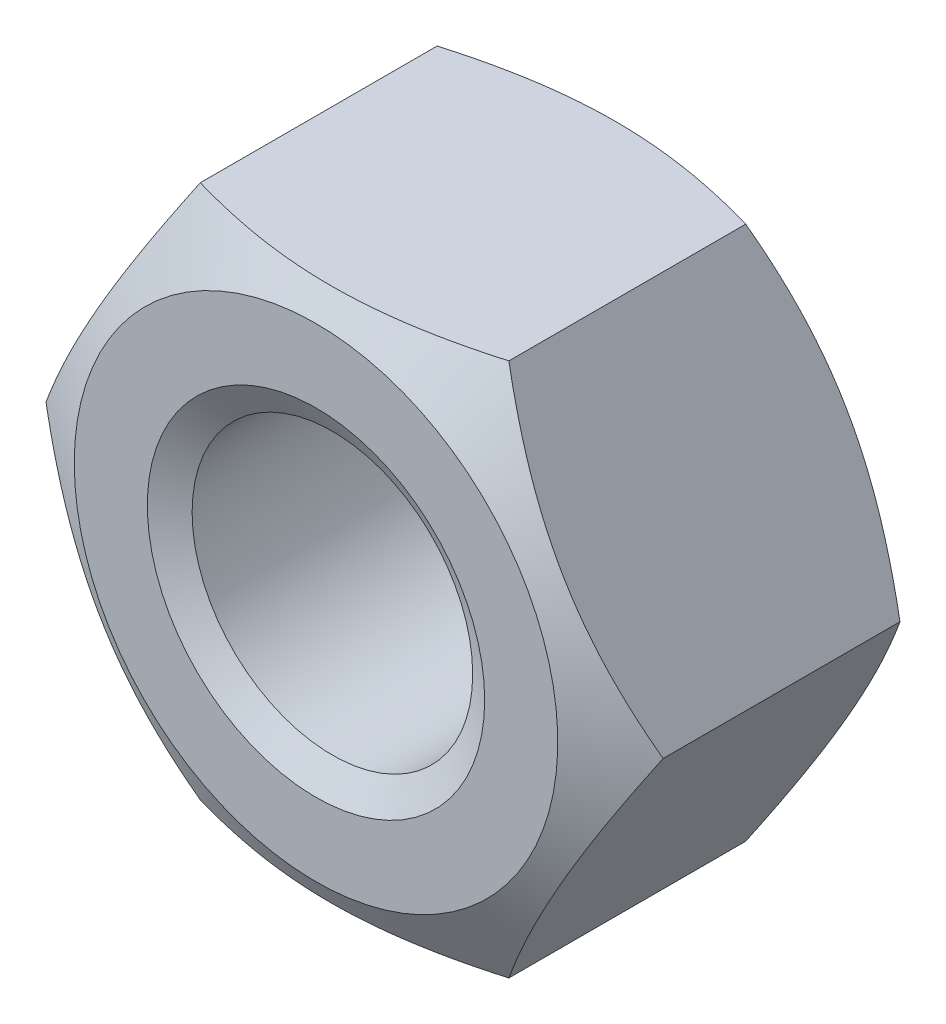
ISO-10303-21;
HEADER;
FILE_DESCRIPTION(('STEP AP214'),'2;1');
FILE_NAME('part.step','',(''),(''),'','','');
FILE_SCHEMA(('AUTOMOTIVE_DESIGN { 1 0 10303 214 1 1 1 1 }'));
ENDSEC;
DATA;
#1=APPLICATION_CONTEXT('core data for automotive mechanical design processes');
#2=APPLICATION_PROTOCOL_DEFINITION('international standard','automotive_design',2000,#1);
#3=PRODUCT_CONTEXT('',#1,'mechanical');
#4=PRODUCT('Part','Part','',(#3));
#5=PRODUCT_RELATED_PRODUCT_CATEGORY('part','',(#4));
#6=PRODUCT_DEFINITION_FORMATION('','',#4);
#7=PRODUCT_DEFINITION_CONTEXT('part definition',#1,'design');
#8=PRODUCT_DEFINITION('design','',#6,#7);
#9=PRODUCT_DEFINITION_SHAPE('','',#8);
#10=(LENGTH_UNIT() NAMED_UNIT(*) SI_UNIT(.MILLI.,.METRE.));
#11=(NAMED_UNIT(*) PLANE_ANGLE_UNIT() SI_UNIT($,.RADIAN.));
#12=(NAMED_UNIT(*) SI_UNIT($,.STERADIAN.) SOLID_ANGLE_UNIT());
#13=UNCERTAINTY_MEASURE_WITH_UNIT(LENGTH_MEASURE(1.E-05),#10,'distance_accuracy_value','');
#14=(GEOMETRIC_REPRESENTATION_CONTEXT(3) GLOBAL_UNCERTAINTY_ASSIGNED_CONTEXT((#13)) GLOBAL_UNIT_ASSIGNED_CONTEXT((#10,
#11,#12)) REPRESENTATION_CONTEXT('',''));
#15=CARTESIAN_POINT('',(0.,0.,0.));
#16=DIRECTION('',(0.,0.,1.));
#17=DIRECTION('',(1.,0.,0.));
#18=AXIS2_PLACEMENT_3D('',#15,#16,#17);
#19=CARTESIAN_POINT('',(0.,0.,4.70000000000004));
#20=DIRECTION('',(0.,0.,1.));
#21=DIRECTION('',(1.,0.,0.));
#22=AXIS2_PLACEMENT_3D('',#19,#20,#21);
#23=PLANE('',#22);
#24=CARTESIAN_POINT('',(0.,0.,4.70000000000004));
#25=DIRECTION('',(0.,0.,1.));
#26=DIRECTION('',(1.,0.,0.));
#27=AXIS2_PLACEMENT_3D('',#24,#25,#26);
#28=CIRCLE('',#27,2.525);
#29=CARTESIAN_POINT('',(2.525,0.,4.70000000000004));
#30=VERTEX_POINT('',#29);
#31=EDGE_CURVE('E123',#30,#30,#28,.T.);
#32=ORIENTED_EDGE('',*,*,#31,.F.);
#33=EDGE_LOOP('',(#32));
#34=FACE_BOUND('',#33,.T.);
#35=CARTESIAN_POINT('',(0.,0.,4.70000000000004));
#36=DIRECTION('',(0.,0.,-1.));
#37=DIRECTION('',(-1.,0.,0.));
#38=AXIS2_PLACEMENT_3D('',#35,#36,#37);
#39=CIRCLE('',#38,3.61880215351701);
#40=CARTESIAN_POINT('',(-3.61880215351701,0.,4.70000000000004));
#41=VERTEX_POINT('',#40);
#42=EDGE_CURVE('E244',#41,#41,#39,.T.);
#43=ORIENTED_EDGE('',*,*,#42,.F.);
#44=EDGE_LOOP('',(#43));
#45=FACE_BOUND('',#44,.T.);
#46=ADVANCED_FACE('F36',(#34,#45),#23,.T.);
#47=CARTESIAN_POINT('',(0.,0.,0.));
#48=DIRECTION('',(0.,0.,1.));
#49=DIRECTION('',(1.,0.,0.));
#50=AXIS2_PLACEMENT_3D('',#47,#48,#49);
#51=PLANE('',#50);
#52=CARTESIAN_POINT('',(0.,0.,0.));
#53=DIRECTION('',(0.,0.,1.));
#54=DIRECTION('',(1.,0.,0.));
#55=AXIS2_PLACEMENT_3D('',#52,#53,#54);
#56=CIRCLE('',#55,2.525);
#57=CARTESIAN_POINT('',(2.525,0.,0.));
#58=VERTEX_POINT('',#57);
#59=EDGE_CURVE('E126',#58,#58,#56,.T.);
#60=ORIENTED_EDGE('',*,*,#59,.T.);
#61=EDGE_LOOP('',(#60));
#62=FACE_BOUND('',#61,.T.);
#63=CARTESIAN_POINT('',(0.,0.,0.));
#64=DIRECTION('',(0.,0.,-1.));
#65=DIRECTION('',(-1.,0.,0.));
#66=AXIS2_PLACEMENT_3D('',#63,#64,#65);
#67=CIRCLE('',#66,3.61880215351701);
#68=CARTESIAN_POINT('',(-3.61880215351701,0.,0.));
#69=VERTEX_POINT('',#68);
#70=EDGE_CURVE('E199',#69,#69,#67,.T.);
#71=ORIENTED_EDGE('',*,*,#70,.T.);
#72=EDGE_LOOP('',(#71));
#73=FACE_BOUND('',#72,.T.);
#74=ADVANCED_FACE('F219',(#62,#73),#51,.F.);
#75=CARTESIAN_POINT('',(4.61880215351701,0.,4.70000000000004));
#76=DIRECTION('',(-0.866025403784439,-0.5,0.));
#77=DIRECTION('',(0.5,-0.866025403784439,0.));
#78=AXIS2_PLACEMENT_3D('',#75,#76,#77);
#79=PLANE('',#78);
#80=DIRECTION('',(0.,0.,-1.));
#81=VECTOR('',#80,1.);
#82=CARTESIAN_POINT('',(2.3094010767585,4.,4.70000000000004));
#83=LINE('',#82,#81);
#84=CARTESIAN_POINT('',(2.3094010767585,4.,4.12264973081033));
#85=VERTEX_POINT('',#84);
#86=CARTESIAN_POINT('',(2.3094010767585,4.,0.577350269189592));
#87=VERTEX_POINT('',#86);
#88=EDGE_CURVE('E11',#85,#87,#83,.T.);
#89=ORIENTED_EDGE('',*,*,#88,.F.);
#90=CARTESIAN_POINT('',(2.30928560670467,4.0002,4.12258306164381));
#91=CARTESIAN_POINT('',(2.41077174646171,3.82442084967677,4.1811974470703));
#92=CARTESIAN_POINT('',(2.513133908835,3.64712438367362,4.23450499925632));
#93=CARTESIAN_POINT('',(2.71963072479812,3.2894614068243,4.32755364997217));
#94=CARTESIAN_POINT('',(2.82376904741904,3.10908854102986,4.36726183168887));
#95=CARTESIAN_POINT('',(3.03075510011795,2.75057818129722,4.4290731054383));
#96=CARTESIAN_POINT('',(3.13357098372492,2.57249584706487,4.45158758919571));
#97=CARTESIAN_POINT('',(3.33968651028528,2.2154932828335,4.47846469757197));
#98=CARTESIAN_POINT('',(3.44298540411433,2.0365743503559,4.48284957929155));
#99=CARTESIAN_POINT('',(3.63600352522932,1.70225715780327,4.47372524777853));
#100=CARTESIAN_POINT('',(3.72575165335065,1.54680884001293,4.46245636673056));
#101=CARTESIAN_POINT('',(3.90466320392055,1.23692494436494,4.4267413299204));
#102=CARTESIAN_POINT('',(3.99382600759479,1.08249043825587,4.40228297500705));
#103=CARTESIAN_POINT('',(4.17310641015197,0.77196767222542,4.34113925579928));
#104=CARTESIAN_POINT('',(4.26320131938131,0.615918711936898,4.30419471706371));
#105=CARTESIAN_POINT('',(4.44204742827551,0.306148164596163,4.22034524817056));
#106=CARTESIAN_POINT('',(4.53080091904967,0.152422609226223,4.17346001850585));
#107=CARTESIAN_POINT('',(4.61891762357085,-0.000199999999998812,4.12258306164381));
#108=B_SPLINE_CURVE_WITH_KNOTS('',3,(#90,#91,#92,#93,#94,#95,#96,#97,#98,#99,#100,#101,#102,
#103,#104,#105,#106,#107),.UNSPECIFIED.,.F.,.F.,(4,2,2,2,2,2,2,2,4),(0.,0.634047835695967,
1.26961969224542,1.88946157213121,2.50854226669296,3.04757825393385,3.58711366126903,
4.13861653143763,4.68903648037742),.UNSPECIFIED.);
#109=CARTESIAN_POINT('',(4.61880215351701,0.,4.12264973081033));
#110=VERTEX_POINT('',#109);
#111=EDGE_CURVE('E195',#85,#110,#108,.T.);
#112=ORIENTED_EDGE('',*,*,#111,.T.);
#113=DIRECTION('',(0.,0.,-1.));
#114=VECTOR('',#113,1.);
#115=CARTESIAN_POINT('',(4.61880215351701,0.,4.70000000000004));
#116=LINE('',#115,#114);
#117=CARTESIAN_POINT('',(4.61880215351701,0.,0.577350269189592));
#118=VERTEX_POINT('',#117);
#119=EDGE_CURVE('E60',#110,#118,#116,.T.);
#120=ORIENTED_EDGE('',*,*,#119,.T.);
#121=CARTESIAN_POINT('',(4.61891762357085,-0.000199999999998812,0.577416938356223));
#122=CARTESIAN_POINT('',(4.51743148381381,0.175579150323227,0.518802552929724));
#123=CARTESIAN_POINT('',(4.41506932144052,0.352875616326379,0.465495000743697));
#124=CARTESIAN_POINT('',(4.2085725054774,0.710538593175705,0.372446350027833));
#125=CARTESIAN_POINT('',(4.10443418285647,0.890911458970151,0.332738168311136));
#126=CARTESIAN_POINT('',(3.89744813015756,1.24942181870279,0.270926894561713));
#127=CARTESIAN_POINT('',(3.7946322465506,1.42750415293514,0.248412410804324));
#128=CARTESIAN_POINT('',(3.58851671999023,1.78450671716651,0.221535302428014));
#129=CARTESIAN_POINT('',(3.48521782616117,1.9634256496441,0.217150420708372));
#130=CARTESIAN_POINT('',(3.29219970504619,2.29774284219673,0.226274752221399));
#131=CARTESIAN_POINT('',(3.20245157692486,2.45319115998707,0.237543633269426));
#132=CARTESIAN_POINT('',(3.02354002635497,2.76307505563506,0.273258670079627));
#133=CARTESIAN_POINT('',(2.93437722268073,2.91750956174413,0.297717024992966));
#134=CARTESIAN_POINT('',(2.75509682012354,3.22803232777458,0.35886074420072));
#135=CARTESIAN_POINT('',(2.6650019108942,3.3840812880631,0.395805282936293));
#136=CARTESIAN_POINT('',(2.48615580200001,3.69385183540384,0.479654751829461));
#137=CARTESIAN_POINT('',(2.39740231122585,3.84757739077378,0.526539981494181));
#138=CARTESIAN_POINT('',(2.30928560670467,4.0002,0.577416938356223));
#139=B_SPLINE_CURVE_WITH_KNOTS('',3,(#121,#122,#123,#124,#125,#126,#127,#128,#129,#130,#131,
#132,#133,#134,#135,#136,#137,#138),.UNSPECIFIED.,.F.,.F.,(4,2,2,2,2,2,2,2,4),(0.,
0.634047835695969,1.26961969224544,1.88946157213123,2.50854226669298,3.04757825393386,
3.58711366126904,4.13861653143764,4.68903648037744),.UNSPECIFIED.);
#140=EDGE_CURVE('E129',#118,#87,#139,.T.);
#141=ORIENTED_EDGE('',*,*,#140,.T.);
#142=EDGE_LOOP('',(#89,#112,#120,#141));
#143=FACE_BOUND('',#142,.T.);
#144=ADVANCED_FACE('F38',(#143),#79,.F.);
#145=CARTESIAN_POINT('',(2.3094010767585,4.,4.70000000000004));
#146=DIRECTION('',(0.,-1.,0.));
#147=DIRECTION('',(0.,0.,-1.));
#148=AXIS2_PLACEMENT_3D('',#145,#146,#147);
#149=PLANE('',#148);
#150=DIRECTION('',(0.,0.,-1.));
#151=VECTOR('',#150,1.);
#152=CARTESIAN_POINT('',(-2.3094010767585,4.,4.70000000000004));
#153=LINE('',#152,#151);
#154=CARTESIAN_POINT('',(-2.3094010767585,4.,4.12264973081033));
#155=VERTEX_POINT('',#154);
#156=CARTESIAN_POINT('',(-2.3094010767585,4.,0.577350269189592));
#157=VERTEX_POINT('',#156);
#158=EDGE_CURVE('E45',#155,#157,#153,.T.);
#159=ORIENTED_EDGE('',*,*,#158,.F.);
#160=CARTESIAN_POINT('',(-6.09439870008624,4.,2.58052815081933));
#161=CARTESIAN_POINT('',(-5.92056709462127,4.,2.66440799071056));
#162=CARTESIAN_POINT('',(-5.7463245067722,4.,2.74745133273696));
#163=CARTESIAN_POINT('',(-5.39679834745252,4.,2.91139217879107));
#164=CARTESIAN_POINT('',(-5.22151460659659,4.,2.99228932126199));
#165=CARTESIAN_POINT('',(-4.86873058864552,4.,3.15189554384562));
#166=CARTESIAN_POINT('',(-4.6912233581124,4.,3.2305893099155));
#167=CARTESIAN_POINT('',(-4.33475821937682,4.,3.3846069905837));
#168=CARTESIAN_POINT('',(-4.15580038365535,4.,3.45993107234068));
#169=CARTESIAN_POINT('',(-3.7908281407519,4.,3.60848180478433));
#170=CARTESIAN_POINT('',(-3.60476145616704,4.,3.68158074442146));
#171=CARTESIAN_POINT('',(-3.23041138049854,4.,3.82197762836034));
#172=CARTESIAN_POINT('',(-3.04212773780156,4.,3.88927490684799));
#173=CARTESIAN_POINT('',(-2.66343337031665,4.,4.01622155863231));
#174=CARTESIAN_POINT('',(-2.47302822636961,4.,4.0758874066397));
#175=CARTESIAN_POINT('',(-2.08949007377857,4.,4.18558533105624));
#176=CARTESIAN_POINT('',(-1.89635797998642,4.,4.23562055967113));
#177=CARTESIAN_POINT('',(-1.50829712802515,4.,4.32332847661919));
#178=CARTESIAN_POINT('',(-1.31338269521051,4.,4.36106334898366));
#179=CARTESIAN_POINT('',(-0.921248890898837,4.,4.42196109737901));
#180=CARTESIAN_POINT('',(-0.724029704709688,4.,4.4451251368414));
#181=CARTESIAN_POINT('',(-0.330799463054093,4.,4.47472893675917));
#182=CARTESIAN_POINT('',(-0.134804330623294,4.,4.48137503581725));
#183=CARTESIAN_POINT('',(0.257050683814243,4.,4.47791638574248));
#184=CARTESIAN_POINT('',(0.45291056081257,4.,4.46781104643771));
#185=CARTESIAN_POINT('',(0.78874443502392,4.,4.43681930503576));
#186=CARTESIAN_POINT('',(0.929086770300285,4.,4.41972062365012));
#187=CARTESIAN_POINT('',(1.20866508678393,4.,4.37804812784635));
#188=CARTESIAN_POINT('',(1.34790090032354,4.,4.35347320193115));
#189=CARTESIAN_POINT('',(1.76380719352866,4.,4.26983435980247));
#190=CARTESIAN_POINT('',(2.03850546613734,4.,4.20087417576413));
#191=CARTESIAN_POINT('',(2.44914041313838,4.,4.08229833701357));
#192=CARTESIAN_POINT('',(2.58722904476809,4.,4.03971908518976));
#193=CARTESIAN_POINT('',(2.862063667265,4.,3.95039002095297));
#194=CARTESIAN_POINT('',(2.99880964951352,4.,3.90364018178769));
#195=CARTESIAN_POINT('',(3.271007501521,4.,3.80669907645057));
#196=CARTESIAN_POINT('',(3.40645983587404,4.,3.75650910310509));
#197=CARTESIAN_POINT('',(3.67625919824858,4.,3.65325267369425));
#198=CARTESIAN_POINT('',(3.81060623649641,4.,3.60018624427675));
#199=CARTESIAN_POINT('',(4.11562280524895,4.,3.47653935993073));
#200=CARTESIAN_POINT('',(4.28598349292156,4.,3.40519857633256));
#201=CARTESIAN_POINT('',(4.62536345858144,4.,3.25938802038879));
#202=CARTESIAN_POINT('',(4.79438267316525,4.,3.18491810118228));
#203=CARTESIAN_POINT('',(5.29980589587935,4.,2.9577393040658));
#204=CARTESIAN_POINT('',(5.63452374641144,4.,2.80128282124505));
#205=CARTESIAN_POINT('',(6.30104248196814,4.,2.48161328613526));
#206=CARTESIAN_POINT('',(6.63284058362901,4.,2.31839448840645));
#207=CARTESIAN_POINT('',(7.29412827568044,4.,1.98733042741953));
#208=CARTESIAN_POINT('',(7.62361779163159,4.,1.81948501583132));
#209=CARTESIAN_POINT('',(8.25536205328134,4.,1.4936414860704));
#210=CARTESIAN_POINT('',(8.55774483760872,4.,1.33589080531252));
#211=CARTESIAN_POINT('',(9.16139293352011,4.,1.01824729645359));
#212=CARTESIAN_POINT('',(9.46265821309699,4.,0.858354407592023));
#213=CARTESIAN_POINT('',(10.0636644368672,4.,0.537267315517387));
#214=CARTESIAN_POINT('',(10.3634072636687,4.,0.376076631097769));
#215=CARTESIAN_POINT('',(10.9621713423212,4.,0.0523938980102709));
#216=CARTESIAN_POINT('',(11.2611926277831,4.,-0.110098088455319));
#217=CARTESIAN_POINT('',(11.5599448570052,4.,-0.273079916735308));
#218=B_SPLINE_CURVE_WITH_KNOTS('',3,(#160,#161,#162,#163,#164,#165,#166,#167,#168,#169,#170,
#171,#172,#173,#174,#175,#176,#177,#178,#179,#180,#181,#182,#183,#184,#185,#186,#187,#188,#189,
#190,#191,#192,#193,#194,#195,#196,#197,#198,#199,#200,#201,#202,#203,#204,#205,#206,#207,#208,
#209,#210,#211,#212,#213,#214,#215,#216,#217),.UNSPECIFIED.,.F.,.F.,(4,2,2,2,2,2,2,2,2,2,2,2,2,
2,2,2,2,2,2,2,2,2,2,2,2,2,2,2,4),(0.,0.579040698495303,1.15817833277575,1.74065677904911,
2.32310629841798,2.92276353531228,3.52248949911162,4.12089810200277,4.71911050497446,
5.31424999029614,5.90934194971789,6.49696191831524,7.08460258986092,7.50853513536051,
7.93253073795216,8.78103558083006,9.21451485463262,9.64799690919332,10.0813169420328,
10.5146329612257,11.0686769640889,11.6227469992164,12.7310549948479,13.8403247652097,
14.9496301404199,15.9727943925241,16.9959877268381,18.0169905333094,19.0379448236906),.UNSPECIFIED.);
#219=EDGE_CURVE('E94',#155,#85,#218,.T.);
#220=ORIENTED_EDGE('',*,*,#219,.T.);
#221=ORIENTED_EDGE('',*,*,#88,.T.);
#222=CARTESIAN_POINT('',(-6.09439870008624,4.,2.11947184918071));
#223=CARTESIAN_POINT('',(-5.92056709462127,4.,2.03559200928946));
#224=CARTESIAN_POINT('',(-5.74632450677221,4.,1.95254866726305));
#225=CARTESIAN_POINT('',(-5.39679834745253,4.,1.78860782120894));
#226=CARTESIAN_POINT('',(-5.2215146065966,4.,1.70771067873802));
#227=CARTESIAN_POINT('',(-4.86873058864553,4.,1.5481044561544));
#228=CARTESIAN_POINT('',(-4.69122335811241,4.,1.46941069008451));
#229=CARTESIAN_POINT('',(-4.33475821937683,4.,1.31539300941632));
#230=CARTESIAN_POINT('',(-4.15580038365536,4.,1.24006892765934));
#231=CARTESIAN_POINT('',(-3.79082814075191,4.,1.09151819521569));
#232=CARTESIAN_POINT('',(-3.60476145616705,4.,1.01841925557855));
#233=CARTESIAN_POINT('',(-3.23041138049855,4.,0.878022371639671));
#234=CARTESIAN_POINT('',(-3.04212773780157,4.,0.810725093152023));
#235=CARTESIAN_POINT('',(-2.66343337031666,4.,0.683778441367701));
#236=CARTESIAN_POINT('',(-2.47302822636962,4.,0.62411259336031));
#237=CARTESIAN_POINT('',(-2.08949007377858,4.,0.514414668943782));
#238=CARTESIAN_POINT('',(-1.89635797998642,4.,0.464379440328912));
#239=CARTESIAN_POINT('',(-1.50829712802515,4.,0.376671523380852));
#240=CARTESIAN_POINT('',(-1.31338269521051,4.,0.338936651016357));
#241=CARTESIAN_POINT('',(-0.92124889089884,4.,0.278038902620989));
#242=CARTESIAN_POINT('',(-0.724029704709691,4.,0.254874863158613));
#243=CARTESIAN_POINT('',(-0.330799463054095,4.,0.225271063240843));
#244=CARTESIAN_POINT('',(-0.134804330623296,4.,0.218624964182749));
#245=CARTESIAN_POINT('',(0.257050683814241,4.,0.222083614257543));
#246=CARTESIAN_POINT('',(0.452910560812568,4.,0.23218895356233));
#247=CARTESIAN_POINT('',(0.788744435023922,4.,0.263180694964278));
#248=CARTESIAN_POINT('',(0.929086770300289,4.,0.280279376349894));
#249=CARTESIAN_POINT('',(1.20866508678394,4.,0.321951872153655));
#250=CARTESIAN_POINT('',(1.34790090032354,4.,0.346526798068861));
#251=CARTESIAN_POINT('',(1.76380719352866,4.,0.430165640197547));
#252=CARTESIAN_POINT('',(2.03850546613734,4.,0.49912582423588));
#253=CARTESIAN_POINT('',(2.44914041313839,4.,0.617701662986443));
#254=CARTESIAN_POINT('',(2.5872290447681,4.,0.660280914810251));
#255=CARTESIAN_POINT('',(2.86206366726501,4.,0.749609979047047));
#256=CARTESIAN_POINT('',(2.99880964951353,4.,0.79635981821232));
#257=CARTESIAN_POINT('',(3.27100750152101,4.,0.89330092354944));
#258=CARTESIAN_POINT('',(3.40645983587405,4.,0.943490896894921));
#259=CARTESIAN_POINT('',(3.67625919824859,4.,1.04674732630577));
#260=CARTESIAN_POINT('',(3.81060623649641,4.,1.09981375572328));
#261=CARTESIAN_POINT('',(4.11562280524895,4.,1.22346064006931));
#262=CARTESIAN_POINT('',(4.28598349292157,4.,1.29480142366746));
#263=CARTESIAN_POINT('',(4.62536345858145,4.,1.44061197961122));
#264=CARTESIAN_POINT('',(4.79438267316526,4.,1.51508189881773));
#265=CARTESIAN_POINT('',(5.29980589587935,4.,1.74226069593422));
#266=CARTESIAN_POINT('',(5.63452374641144,4.,1.89871717875497));
#267=CARTESIAN_POINT('',(6.30104248196814,4.,2.21838671386475));
#268=CARTESIAN_POINT('',(6.632840583629,4.,2.38160551159355));
#269=CARTESIAN_POINT('',(7.29412827568043,4.,2.71266957258048));
#270=CARTESIAN_POINT('',(7.62361779163159,4.,2.88051498416868));
#271=CARTESIAN_POINT('',(8.25536205328132,4.,3.2063585139296));
#272=CARTESIAN_POINT('',(8.55774483760871,4.,3.36410919468748));
#273=CARTESIAN_POINT('',(9.16139293352009,4.,3.68175270354641));
#274=CARTESIAN_POINT('',(9.46265821309697,4.,3.84164559240797));
#275=CARTESIAN_POINT('',(10.0636644368671,4.,4.16273268448261));
#276=CARTESIAN_POINT('',(10.3634072636687,4.,4.32392336890223));
#277=CARTESIAN_POINT('',(10.9621713423212,4.,4.64760610198972));
#278=CARTESIAN_POINT('',(11.2611926277831,4.,4.81009808845529));
#279=CARTESIAN_POINT('',(11.5599448570052,4.,4.97307991673523));
#280=B_SPLINE_CURVE_WITH_KNOTS('',3,(#222,#223,#224,#225,#226,#227,#228,#229,#230,#231,#232,
#233,#234,#235,#236,#237,#238,#239,#240,#241,#242,#243,#244,#245,#246,#247,#248,#249,#250,#251,
#252,#253,#254,#255,#256,#257,#258,#259,#260,#261,#262,#263,#264,#265,#266,#267,#268,#269,#270,
#271,#272,#273,#274,#275,#276,#277,#278,#279),.UNSPECIFIED.,.F.,.F.,(4,2,2,2,2,2,2,2,2,2,2,2,2,
2,2,2,2,2,2,2,2,2,2,2,2,2,2,2,4),(0.,0.579040698495306,1.15817833277575,1.74065677904911,
2.32310629841799,2.92276353531228,3.52248949911162,4.12089810200277,4.71911050497447,
5.31424999029614,5.9093419497179,6.49696191831525,7.08460258986094,7.50853513536052,
7.93253073795217,8.78103558083008,9.21451485463263,9.64799690919334,10.0813169420328,
10.5146329612257,11.068676964089,11.6227469992165,12.7310549948479,13.8403247652097,
14.9496301404199,15.9727943925241,16.9959877268381,18.0169905333094,19.0379448236906),.UNSPECIFIED.);
#281=EDGE_CURVE('E135',#87,#157,#280,.F.);
#282=ORIENTED_EDGE('',*,*,#281,.T.);
#283=EDGE_LOOP('',(#159,#220,#221,#282));
#284=FACE_BOUND('',#283,.T.);
#285=ADVANCED_FACE('F179',(#284),#149,.F.);
#286=CARTESIAN_POINT('',(-2.3094010767585,4.,4.70000000000004));
#287=DIRECTION('',(0.866025403784439,-0.5,0.));
#288=DIRECTION('',(0.5,0.866025403784439,0.));
#289=AXIS2_PLACEMENT_3D('',#286,#287,#288);
#290=PLANE('',#289);
#291=DIRECTION('',(0.,0.,-1.));
#292=VECTOR('',#291,1.);
#293=CARTESIAN_POINT('',(-4.61880215351701,0.,4.70000000000004));
#294=LINE('',#293,#292);
#295=CARTESIAN_POINT('',(-4.61880215351701,0.,4.12264973081033));
#296=VERTEX_POINT('',#295);
#297=CARTESIAN_POINT('',(-4.61880215351701,0.,0.577350269189592));
#298=VERTEX_POINT('',#297);
#299=EDGE_CURVE('E103',#296,#298,#294,.T.);
#300=ORIENTED_EDGE('',*,*,#299,.F.);
#301=CARTESIAN_POINT('',(-4.61891762357085,-0.000199999999998812,4.12258306164381));
#302=CARTESIAN_POINT('',(-4.51743148381381,0.175579150323229,4.1811974470703));
#303=CARTESIAN_POINT('',(-4.41506932144052,0.352875616326382,4.23450499925632));
#304=CARTESIAN_POINT('',(-4.2085725054774,0.710538593175705,4.32755364997217));
#305=CARTESIAN_POINT('',(-4.10443418285647,0.890911458970146,4.36726183168887));
#306=CARTESIAN_POINT('',(-3.89744813015757,1.24942181870278,4.42907310543831));
#307=CARTESIAN_POINT('',(-3.7946322465506,1.42750415293513,4.45158758919571));
#308=CARTESIAN_POINT('',(-3.58851671999023,1.7845067171665,4.47846469757197));
#309=CARTESIAN_POINT('',(-3.48521782616117,1.9634256496441,4.48284957929155));
#310=CARTESIAN_POINT('',(-3.29219970504618,2.29774284219673,4.47372524777853));
#311=CARTESIAN_POINT('',(-3.20245157692486,2.45319115998707,4.46245636673056));
#312=CARTESIAN_POINT('',(-3.02354002635496,2.76307505563507,4.4267413299204));
#313=CARTESIAN_POINT('',(-2.93437722268072,2.91750956174414,4.40228297500705));
#314=CARTESIAN_POINT('',(-2.75509682012354,3.22803232777458,4.34113925579928));
#315=CARTESIAN_POINT('',(-2.6650019108942,3.3840812880631,4.30419471706371));
#316=CARTESIAN_POINT('',(-2.48615580200001,3.69385183540384,4.22034524817056));
#317=CARTESIAN_POINT('',(-2.39740231122585,3.84757739077378,4.17346001850585));
#318=CARTESIAN_POINT('',(-2.30928560670467,4.0002,4.12258306164381));
#319=B_SPLINE_CURVE_WITH_KNOTS('',3,(#301,#302,#303,#304,#305,#306,#307,#308,#309,#310,#311,
#312,#313,#314,#315,#316,#317,#318),.UNSPECIFIED.,.F.,.F.,(4,2,2,2,2,2,2,2,4),(0.,
0.634047835695968,1.26961969224542,1.88946157213121,2.50854226669297,3.04757825393386,
3.58711366126904,4.13861653143763,4.68903648037742),.UNSPECIFIED.);
#320=EDGE_CURVE('E89',#296,#155,#319,.T.);
#321=ORIENTED_EDGE('',*,*,#320,.T.);
#322=ORIENTED_EDGE('',*,*,#158,.T.);
#323=CARTESIAN_POINT('',(-2.30928560670467,4.0002,0.577416938356223));
#324=CARTESIAN_POINT('',(-2.4107717464617,3.82442084967677,0.518802552929723));
#325=CARTESIAN_POINT('',(-2.51313390883499,3.64712438367362,0.465495000743697));
#326=CARTESIAN_POINT('',(-2.71963072479812,3.28946140682429,0.372446350027832));
#327=CARTESIAN_POINT('',(-2.82376904741904,3.10908854102985,0.332738168311135));
#328=CARTESIAN_POINT('',(-3.03075510011795,2.75057818129721,0.270926894561712));
#329=CARTESIAN_POINT('',(-3.13357098372492,2.57249584706486,0.248412410804323));
#330=CARTESIAN_POINT('',(-3.33968651028529,2.21549328283349,0.221535302428013));
#331=CARTESIAN_POINT('',(-3.44298540411435,2.0365743503559,0.217150420708372));
#332=CARTESIAN_POINT('',(-3.63600352522933,1.70225715780327,0.226274752221399));
#333=CARTESIAN_POINT('',(-3.72575165335065,1.54680884001293,0.237543633269426));
#334=CARTESIAN_POINT('',(-3.90466320392054,1.23692494436494,0.273258670079627));
#335=CARTESIAN_POINT('',(-3.99382600759479,1.08249043825587,0.297717024992966));
#336=CARTESIAN_POINT('',(-4.17310641015197,0.77196767222542,0.35886074420072));
#337=CARTESIAN_POINT('',(-4.26320131938131,0.615918711936894,0.395805282936293));
#338=CARTESIAN_POINT('',(-4.44204742827551,0.306148164596157,0.479654751829461));
#339=CARTESIAN_POINT('',(-4.53080091904967,0.152422609226218,0.526539981494181));
#340=CARTESIAN_POINT('',(-4.61891762357085,-0.000199999999998812,0.577416938356223));
#341=B_SPLINE_CURVE_WITH_KNOTS('',3,(#323,#324,#325,#326,#327,#328,#329,#330,#331,#332,#333,
#334,#335,#336,#337,#338,#339,#340),.UNSPECIFIED.,.F.,.F.,(4,2,2,2,2,2,2,2,4),(0.,
0.63404783569597,1.26961969224544,1.88946157213123,2.50854226669298,3.04757825393386,
3.58711366126904,4.13861653143765,4.68903648037744),.UNSPECIFIED.);
#342=EDGE_CURVE('E110',#157,#298,#341,.T.);
#343=ORIENTED_EDGE('',*,*,#342,.T.);
#344=EDGE_LOOP('',(#300,#321,#322,#343));
#345=FACE_BOUND('',#344,.T.);
#346=ADVANCED_FACE('F108',(#345),#290,.F.);
#347=CARTESIAN_POINT('',(-4.61880215351701,0.,4.70000000000004));
#348=DIRECTION('',(0.866025403784439,0.5,0.));
#349=DIRECTION('',(-0.5,0.866025403784439,0.));
#350=AXIS2_PLACEMENT_3D('',#347,#348,#349);
#351=PLANE('',#350);
#352=DIRECTION('',(0.,0.,-1.));
#353=VECTOR('',#352,1.);
#354=CARTESIAN_POINT('',(-2.3094010767585,-4.,4.70000000000004));
#355=LINE('',#354,#353);
#356=CARTESIAN_POINT('',(-2.3094010767585,-4.,4.12264973081033));
#357=VERTEX_POINT('',#356);
#358=CARTESIAN_POINT('',(-2.3094010767585,-4.,0.577350269189592));
#359=VERTEX_POINT('',#358);
#360=EDGE_CURVE('E105',#357,#359,#355,.T.);
#361=ORIENTED_EDGE('',*,*,#360,.F.);
#362=CARTESIAN_POINT('',(-2.30928560670467,-4.0002,4.12258306164381));
#363=CARTESIAN_POINT('',(-2.41077174646171,-3.82442084967677,4.1811974470703));
#364=CARTESIAN_POINT('',(-2.513133908835,-3.64712438367362,4.23450499925632));
#365=CARTESIAN_POINT('',(-2.71963072479812,-3.2894614068243,4.32755364997217));
#366=CARTESIAN_POINT('',(-2.82376904741904,-3.10908854102986,4.36726183168887));
#367=CARTESIAN_POINT('',(-3.03075510011795,-2.75057818129722,4.4290731054383));
#368=CARTESIAN_POINT('',(-3.13357098372492,-2.57249584706487,4.45158758919571));
#369=CARTESIAN_POINT('',(-3.33968651028528,-2.2154932828335,4.47846469757197));
#370=CARTESIAN_POINT('',(-3.44298540411433,-2.0365743503559,4.48284957929155));
#371=CARTESIAN_POINT('',(-3.63600352522932,-1.70225715780327,4.47372524777853));
#372=CARTESIAN_POINT('',(-3.72575165335065,-1.54680884001293,4.46245636673056));
#373=CARTESIAN_POINT('',(-3.90466320392055,-1.23692494436494,4.4267413299204));
#374=CARTESIAN_POINT('',(-3.99382600759479,-1.08249043825586,4.40228297500705));
#375=CARTESIAN_POINT('',(-4.17310641015198,-0.771967672225419,4.34113925579928));
#376=CARTESIAN_POINT('',(-4.26320131938131,-0.615918711936897,4.30419471706371));
#377=CARTESIAN_POINT('',(-4.44204742827551,-0.306148164596161,4.22034524817056));
#378=CARTESIAN_POINT('',(-4.53080091904967,-0.15242260922622,4.17346001850585));
#379=CARTESIAN_POINT('',(-4.61891762357085,0.000200000000002282,4.12258306164381));
#380=B_SPLINE_CURVE_WITH_KNOTS('',3,(#362,#363,#364,#365,#366,#367,#368,#369,#370,#371,#372,
#373,#374,#375,#376,#377,#378,#379),.UNSPECIFIED.,.F.,.F.,(4,2,2,2,2,2,2,2,4),(0.,
0.634047835695967,1.26961969224542,1.88946157213121,2.50854226669296,3.04757825393385,
3.58711366126903,4.13861653143763,4.68903648037742),.UNSPECIFIED.);
#381=EDGE_CURVE('E92',#357,#296,#380,.T.);
#382=ORIENTED_EDGE('',*,*,#381,.T.);
#383=ORIENTED_EDGE('',*,*,#299,.T.);
#384=CARTESIAN_POINT('',(-4.61891762357085,0.000200000000002282,0.577416938356223));
#385=CARTESIAN_POINT('',(-4.51743148381381,-0.175579150323223,0.518802552929724));
#386=CARTESIAN_POINT('',(-4.41506932144052,-0.352875616326376,0.465495000743698));
#387=CARTESIAN_POINT('',(-4.2085725054774,-0.710538593175703,0.372446350027834));
#388=CARTESIAN_POINT('',(-4.10443418285647,-0.890911458970149,0.332738168311137));
#389=CARTESIAN_POINT('',(-3.89744813015756,-1.24942181870279,0.270926894561714));
#390=CARTESIAN_POINT('',(-3.7946322465506,-1.42750415293514,0.248412410804324));
#391=CARTESIAN_POINT('',(-3.58851671999023,-1.78450671716651,0.221535302428014));
#392=CARTESIAN_POINT('',(-3.48521782616117,-1.9634256496441,0.217150420708372));
#393=CARTESIAN_POINT('',(-3.29219970504619,-2.29774284219673,0.226274752221399));
#394=CARTESIAN_POINT('',(-3.20245157692487,-2.45319115998707,0.237543633269427));
#395=CARTESIAN_POINT('',(-3.02354002635497,-2.76307505563506,0.273258670079628));
#396=CARTESIAN_POINT('',(-2.93437722268073,-2.91750956174413,0.297717024992967));
#397=CARTESIAN_POINT('',(-2.75509682012354,-3.22803232777458,0.358860744200721));
#398=CARTESIAN_POINT('',(-2.6650019108942,-3.38408128806311,0.395805282936293));
#399=CARTESIAN_POINT('',(-2.48615580200001,-3.69385183540384,0.479654751829461));
#400=CARTESIAN_POINT('',(-2.39740231122585,-3.84757739077378,0.526539981494181));
#401=CARTESIAN_POINT('',(-2.30928560670467,-4.0002,0.577416938356223));
#402=B_SPLINE_CURVE_WITH_KNOTS('',3,(#384,#385,#386,#387,#388,#389,#390,#391,#392,#393,#394,
#395,#396,#397,#398,#399,#400,#401),.UNSPECIFIED.,.F.,.F.,(4,2,2,2,2,2,2,2,4),(0.,
0.63404783569597,1.26961969224544,1.88946157213123,2.50854226669298,3.04757825393387,
3.58711366126904,4.13861653143765,4.68903648037745),.UNSPECIFIED.);
#403=EDGE_CURVE('E168',#298,#359,#402,.T.);
#404=ORIENTED_EDGE('',*,*,#403,.T.);
#405=EDGE_LOOP('',(#361,#382,#383,#404));
#406=FACE_BOUND('',#405,.T.);
#407=ADVANCED_FACE('F101',(#406),#351,.F.);
#408=CARTESIAN_POINT('',(-2.3094010767585,-4.,4.70000000000004));
#409=DIRECTION('',(0.,1.,0.));
#410=DIRECTION('',(0.,0.,1.));
#411=AXIS2_PLACEMENT_3D('',#408,#409,#410);
#412=PLANE('',#411);
#413=DIRECTION('',(0.,0.,-1.));
#414=VECTOR('',#413,1.);
#415=CARTESIAN_POINT('',(2.3094010767585,-4.,4.70000000000004));
#416=LINE('',#415,#414);
#417=CARTESIAN_POINT('',(2.3094010767585,-4.,4.12264973081033));
#418=VERTEX_POINT('',#417);
#419=CARTESIAN_POINT('',(2.3094010767585,-4.,0.577350269189592));
#420=VERTEX_POINT('',#419);
#421=EDGE_CURVE('E112',#418,#420,#416,.T.);
#422=ORIENTED_EDGE('',*,*,#421,.F.);
#423=CARTESIAN_POINT('',(-6.09439870008624,-4.,2.58052815081933));
#424=CARTESIAN_POINT('',(-5.92056709462127,-4.,2.66440799071056));
#425=CARTESIAN_POINT('',(-5.7463245067722,-4.,2.74745133273696));
#426=CARTESIAN_POINT('',(-5.39679834745252,-4.,2.91139217879107));
#427=CARTESIAN_POINT('',(-5.2215146065966,-4.,2.99228932126199));
#428=CARTESIAN_POINT('',(-4.86873058864552,-4.,3.15189554384561));
#429=CARTESIAN_POINT('',(-4.6912233581124,-4.,3.2305893099155));
#430=CARTESIAN_POINT('',(-4.33475821937683,-4.,3.38460699058369));
#431=CARTESIAN_POINT('',(-4.15580038365536,-4.,3.45993107234068));
#432=CARTESIAN_POINT('',(-3.7908281407519,-4.,3.60848180478433));
#433=CARTESIAN_POINT('',(-3.60476145616704,-4.,3.68158074442146));
#434=CARTESIAN_POINT('',(-3.23041138049854,-4.,3.82197762836034));
#435=CARTESIAN_POINT('',(-3.04212773780156,-4.,3.88927490684799));
#436=CARTESIAN_POINT('',(-2.66343337031665,-4.,4.01622155863231));
#437=CARTESIAN_POINT('',(-2.47302822636961,-4.,4.0758874066397));
#438=CARTESIAN_POINT('',(-2.08949007377857,-4.,4.18558533105624));
#439=CARTESIAN_POINT('',(-1.89635797998642,-4.,4.23562055967113));
#440=CARTESIAN_POINT('',(-1.50829712802515,-4.,4.32332847661919));
#441=CARTESIAN_POINT('',(-1.31338269521051,-4.,4.36106334898366));
#442=CARTESIAN_POINT('',(-0.921248890898832,-4.,4.42196109737902));
#443=CARTESIAN_POINT('',(-0.724029704709682,-4.,4.4451251368414));
#444=CARTESIAN_POINT('',(-0.330799463054085,-4.,4.47472893675917));
#445=CARTESIAN_POINT('',(-0.134804330623284,-4.,4.48137503581725));
#446=CARTESIAN_POINT('',(0.257050683814255,-4.,4.47791638574248));
#447=CARTESIAN_POINT('',(0.452910560812583,-4.,4.46781104643771));
#448=CARTESIAN_POINT('',(0.788744435023933,-4.,4.43681930503576));
#449=CARTESIAN_POINT('',(0.929086770300298,-4.,4.41972062365012));
#450=CARTESIAN_POINT('',(1.20866508678394,-4.,4.37804812784635));
#451=CARTESIAN_POINT('',(1.34790090032355,-4.,4.35347320193115));
#452=CARTESIAN_POINT('',(1.76380719352866,-4.,4.26983435980247));
#453=CARTESIAN_POINT('',(2.03850546613734,-4.,4.20087417576413));
#454=CARTESIAN_POINT('',(2.44914041313839,-4.,4.08229833701357));
#455=CARTESIAN_POINT('',(2.58722904476809,-4.,4.03971908518976));
#456=CARTESIAN_POINT('',(2.86206366726501,-4.,3.95039002095296));
#457=CARTESIAN_POINT('',(2.99880964951353,-4.,3.90364018178769));
#458=CARTESIAN_POINT('',(3.271007501521,-4.,3.80669907645057));
#459=CARTESIAN_POINT('',(3.40645983587404,-4.,3.75650910310509));
#460=CARTESIAN_POINT('',(3.67625919824858,-4.,3.65325267369425));
#461=CARTESIAN_POINT('',(3.81060623649641,-4.,3.60018624427675));
#462=CARTESIAN_POINT('',(4.11562280524895,-4.,3.47653935993073));
#463=CARTESIAN_POINT('',(4.28598349292156,-4.,3.40519857633256));
#464=CARTESIAN_POINT('',(4.62536345858144,-4.,3.25938802038879));
#465=CARTESIAN_POINT('',(4.79438267316525,-4.,3.18491810118228));
#466=CARTESIAN_POINT('',(5.29980589587935,-4.,2.9577393040658));
#467=CARTESIAN_POINT('',(5.63452374641144,-4.,2.80128282124505));
#468=CARTESIAN_POINT('',(6.30104248196814,-4.,2.48161328613526));
#469=CARTESIAN_POINT('',(6.63284058362901,-4.,2.31839448840645));
#470=CARTESIAN_POINT('',(7.29412827568043,-4.,1.98733042741953));
#471=CARTESIAN_POINT('',(7.62361779163159,-4.,1.81948501583132));
#472=CARTESIAN_POINT('',(8.25536205328134,-4.,1.4936414860704));
#473=CARTESIAN_POINT('',(8.55774483760872,-4.,1.33589080531252));
#474=CARTESIAN_POINT('',(9.16139293352011,-4.,1.01824729645359));
#475=CARTESIAN_POINT('',(9.46265821309699,-4.,0.858354407592022));
#476=CARTESIAN_POINT('',(10.0636644368672,-4.,0.537267315517387));
#477=CARTESIAN_POINT('',(10.3634072636687,-4.,0.376076631097769));
#478=CARTESIAN_POINT('',(10.9621713423212,-4.,0.0523938980102707));
#479=CARTESIAN_POINT('',(11.2611926277831,-4.,-0.110098088455319));
#480=CARTESIAN_POINT('',(11.5599448570052,-4.,-0.273079916735308));
#481=B_SPLINE_CURVE_WITH_KNOTS('',3,(#423,#424,#425,#426,#427,#428,#429,#430,#431,#432,#433,
#434,#435,#436,#437,#438,#439,#440,#441,#442,#443,#444,#445,#446,#447,#448,#449,#450,#451,#452,
#453,#454,#455,#456,#457,#458,#459,#460,#461,#462,#463,#464,#465,#466,#467,#468,#469,#470,#471,
#472,#473,#474,#475,#476,#477,#478,#479,#480),.UNSPECIFIED.,.F.,.F.,(4,2,2,2,2,2,2,2,2,2,2,2,2,
2,2,2,2,2,2,2,2,2,2,2,2,2,2,2,4),(0.,0.579040698495302,1.15817833277575,1.7406567790491,
2.32310629841798,2.92276353531228,3.52248949911162,4.12089810200277,4.71911050497446,
5.31424999029614,5.9093419497179,6.49696191831525,7.08460258986094,7.50853513536052,
7.93253073795217,8.78103558083007,9.21451485463262,9.64799690919333,10.0813169420328,
10.5146329612257,11.068676964089,11.6227469992164,12.7310549948479,13.8403247652097,
14.9496301404199,15.9727943925241,16.9959877268381,18.0169905333094,19.0379448236906),.UNSPECIFIED.);
#482=EDGE_CURVE('E52',#418,#357,#481,.F.);
#483=ORIENTED_EDGE('',*,*,#482,.T.);
#484=ORIENTED_EDGE('',*,*,#360,.T.);
#485=CARTESIAN_POINT('',(-6.09439870008624,-4.,2.11947184918071));
#486=CARTESIAN_POINT('',(-5.92056709462127,-4.,2.03559200928946));
#487=CARTESIAN_POINT('',(-5.74632450677221,-4.,1.95254866726305));
#488=CARTESIAN_POINT('',(-5.39679834745253,-4.,1.78860782120894));
#489=CARTESIAN_POINT('',(-5.2215146065966,-4.,1.70771067873802));
#490=CARTESIAN_POINT('',(-4.86873058864553,-4.,1.5481044561544));
#491=CARTESIAN_POINT('',(-4.69122335811241,-4.,1.46941069008451));
#492=CARTESIAN_POINT('',(-4.33475821937683,-4.,1.31539300941632));
#493=CARTESIAN_POINT('',(-4.15580038365536,-4.,1.24006892765934));
#494=CARTESIAN_POINT('',(-3.79082814075191,-4.,1.09151819521569));
#495=CARTESIAN_POINT('',(-3.60476145616705,-4.,1.01841925557855));
#496=CARTESIAN_POINT('',(-3.23041138049855,-4.,0.878022371639671));
#497=CARTESIAN_POINT('',(-3.04212773780157,-4.,0.810725093152023));
#498=CARTESIAN_POINT('',(-2.66343337031666,-4.,0.683778441367701));
#499=CARTESIAN_POINT('',(-2.47302822636962,-4.,0.62411259336031));
#500=CARTESIAN_POINT('',(-2.08949007377858,-4.,0.514414668943782));
#501=CARTESIAN_POINT('',(-1.89635797998642,-4.,0.464379440328912));
#502=CARTESIAN_POINT('',(-1.50829712802515,-4.,0.376671523380852));
#503=CARTESIAN_POINT('',(-1.31338269521051,-4.,0.338936651016357));
#504=CARTESIAN_POINT('',(-0.92124889089884,-4.,0.278038902620989));
#505=CARTESIAN_POINT('',(-0.724029704709691,-4.,0.254874863158613));
#506=CARTESIAN_POINT('',(-0.330799463054095,-4.,0.225271063240843));
#507=CARTESIAN_POINT('',(-0.134804330623296,-4.,0.218624964182749));
#508=CARTESIAN_POINT('',(0.257050683814241,-4.,0.222083614257543));
#509=CARTESIAN_POINT('',(0.452910560812568,-4.,0.23218895356233));
#510=CARTESIAN_POINT('',(0.788744435023922,-4.,0.263180694964278));
#511=CARTESIAN_POINT('',(0.929086770300289,-4.,0.280279376349894));
#512=CARTESIAN_POINT('',(1.20866508678394,-4.,0.321951872153655));
#513=CARTESIAN_POINT('',(1.34790090032354,-4.,0.346526798068861));
#514=CARTESIAN_POINT('',(1.76380719352866,-4.,0.430165640197547));
#515=CARTESIAN_POINT('',(2.03850546613734,-4.,0.49912582423588));
#516=CARTESIAN_POINT('',(2.44914041313839,-4.,0.617701662986443));
#517=CARTESIAN_POINT('',(2.5872290447681,-4.,0.660280914810251));
#518=CARTESIAN_POINT('',(2.86206366726501,-4.,0.749609979047047));
#519=CARTESIAN_POINT('',(2.99880964951353,-4.,0.79635981821232));
#520=CARTESIAN_POINT('',(3.27100750152101,-4.,0.89330092354944));
#521=CARTESIAN_POINT('',(3.40645983587405,-4.,0.943490896894921));
#522=CARTESIAN_POINT('',(3.67625919824859,-4.,1.04674732630577));
#523=CARTESIAN_POINT('',(3.81060623649641,-4.,1.09981375572328));
#524=CARTESIAN_POINT('',(4.11562280524895,-4.,1.22346064006931));
#525=CARTESIAN_POINT('',(4.28598349292157,-4.,1.29480142366746));
#526=CARTESIAN_POINT('',(4.62536345858145,-4.,1.44061197961122));
#527=CARTESIAN_POINT('',(4.79438267316526,-4.,1.51508189881773));
#528=CARTESIAN_POINT('',(5.29980589587935,-4.,1.74226069593422));
#529=CARTESIAN_POINT('',(5.63452374641144,-4.,1.89871717875497));
#530=CARTESIAN_POINT('',(6.30104248196814,-4.,2.21838671386475));
#531=CARTESIAN_POINT('',(6.632840583629,-4.,2.38160551159355));
#532=CARTESIAN_POINT('',(7.29412827568043,-4.,2.71266957258048));
#533=CARTESIAN_POINT('',(7.62361779163159,-4.,2.88051498416868));
#534=CARTESIAN_POINT('',(8.25536205328132,-4.,3.2063585139296));
#535=CARTESIAN_POINT('',(8.55774483760871,-4.,3.36410919468748));
#536=CARTESIAN_POINT('',(9.16139293352009,-4.,3.68175270354641));
#537=CARTESIAN_POINT('',(9.46265821309697,-4.,3.84164559240797));
#538=CARTESIAN_POINT('',(10.0636644368671,-4.,4.16273268448261));
#539=CARTESIAN_POINT('',(10.3634072636687,-4.,4.32392336890223));
#540=CARTESIAN_POINT('',(10.9621713423212,-4.,4.64760610198972));
#541=CARTESIAN_POINT('',(11.2611926277831,-4.,4.81009808845529));
#542=CARTESIAN_POINT('',(11.5599448570052,-4.,4.97307991673523));
#543=B_SPLINE_CURVE_WITH_KNOTS('',3,(#485,#486,#487,#488,#489,#490,#491,#492,#493,#494,#495,
#496,#497,#498,#499,#500,#501,#502,#503,#504,#505,#506,#507,#508,#509,#510,#511,#512,#513,#514,
#515,#516,#517,#518,#519,#520,#521,#522,#523,#524,#525,#526,#527,#528,#529,#530,#531,#532,#533,
#534,#535,#536,#537,#538,#539,#540,#541,#542),.UNSPECIFIED.,.F.,.F.,(4,2,2,2,2,2,2,2,2,2,2,2,2,
2,2,2,2,2,2,2,2,2,2,2,2,2,2,2,4),(0.,0.579040698495306,1.15817833277575,1.74065677904911,
2.32310629841799,2.92276353531228,3.52248949911162,4.12089810200277,4.71911050497447,
5.31424999029614,5.9093419497179,6.49696191831525,7.08460258986094,7.50853513536052,
7.93253073795217,8.78103558083008,9.21451485463263,9.64799690919334,10.0813169420328,
10.5146329612257,11.068676964089,11.6227469992165,12.7310549948479,13.8403247652097,
14.9496301404199,15.9727943925241,16.9959877268381,18.0169905333094,19.0379448236906),.UNSPECIFIED.);
#544=EDGE_CURVE('E161',#359,#420,#543,.T.);
#545=ORIENTED_EDGE('',*,*,#544,.T.);
#546=EDGE_LOOP('',(#422,#483,#484,#545));
#547=FACE_BOUND('',#546,.T.);
#548=ADVANCED_FACE('F235',(#547),#412,.F.);
#549=CARTESIAN_POINT('',(2.3094010767585,-4.,4.70000000000004));
#550=DIRECTION('',(-0.866025403784439,0.5,0.));
#551=DIRECTION('',(-0.5,-0.866025403784439,0.));
#552=AXIS2_PLACEMENT_3D('',#549,#550,#551);
#553=PLANE('',#552);
#554=ORIENTED_EDGE('',*,*,#119,.F.);
#555=CARTESIAN_POINT('',(4.61891762357085,0.000200000000002282,4.12258306164381));
#556=CARTESIAN_POINT('',(4.51743148381381,-0.175579150323227,4.1811974470703));
#557=CARTESIAN_POINT('',(4.41506932144052,-0.352875616326381,4.23450499925632));
#558=CARTESIAN_POINT('',(4.2085725054774,-0.710538593175704,4.32755364997217));
#559=CARTESIAN_POINT('',(4.10443418285647,-0.890911458970145,4.36726183168887));
#560=CARTESIAN_POINT('',(3.89744813015757,-1.24942181870278,4.4290731054383));
#561=CARTESIAN_POINT('',(3.7946322465506,-1.42750415293513,4.45158758919571));
#562=CARTESIAN_POINT('',(3.58851671999023,-1.7845067171665,4.47846469757197));
#563=CARTESIAN_POINT('',(3.48521782616117,-1.9634256496441,4.48284957929155));
#564=CARTESIAN_POINT('',(3.29219970504618,-2.29774284219673,4.47372524777853));
#565=CARTESIAN_POINT('',(3.20245157692486,-2.45319115998707,4.46245636673056));
#566=CARTESIAN_POINT('',(3.02354002635496,-2.76307505563507,4.4267413299204));
#567=CARTESIAN_POINT('',(2.93437722268072,-2.91750956174414,4.40228297500705));
#568=CARTESIAN_POINT('',(2.75509682012354,-3.22803232777458,4.34113925579928));
#569=CARTESIAN_POINT('',(2.6650019108942,-3.3840812880631,4.30419471706371));
#570=CARTESIAN_POINT('',(2.48615580200001,-3.69385183540384,4.22034524817056));
#571=CARTESIAN_POINT('',(2.39740231122585,-3.84757739077378,4.17346001850585));
#572=CARTESIAN_POINT('',(2.30928560670467,-4.0002,4.12258306164381));
#573=B_SPLINE_CURVE_WITH_KNOTS('',3,(#555,#556,#557,#558,#559,#560,#561,#562,#563,#564,#565,
#566,#567,#568,#569,#570,#571,#572),.UNSPECIFIED.,.F.,.F.,(4,2,2,2,2,2,2,2,4),(0.,
0.634047835695969,1.26961969224542,1.88946157213121,2.50854226669297,3.04757825393386,
3.58711366126904,4.13861653143763,4.68903648037742),.UNSPECIFIED.);
#574=EDGE_CURVE('E239',#110,#418,#573,.T.);
#575=ORIENTED_EDGE('',*,*,#574,.T.);
#576=ORIENTED_EDGE('',*,*,#421,.T.);
#577=CARTESIAN_POINT('',(2.30928560670467,-4.0002,0.577416938356223));
#578=CARTESIAN_POINT('',(2.41077174646171,-3.82442084967677,0.518802552929723));
#579=CARTESIAN_POINT('',(2.51313390883499,-3.64712438367362,0.465495000743697));
#580=CARTESIAN_POINT('',(2.71963072479811,-3.2894614068243,0.372446350027833));
#581=CARTESIAN_POINT('',(2.82376904741904,-3.10908854102985,0.332738168311135));
#582=CARTESIAN_POINT('',(3.03075510011795,-2.75057818129721,0.270926894561713));
#583=CARTESIAN_POINT('',(3.13357098372492,-2.57249584706486,0.248412410804323));
#584=CARTESIAN_POINT('',(3.33968651028528,-2.21549328283349,0.221535302428014));
#585=CARTESIAN_POINT('',(3.44298540411433,-2.0365743503559,0.217150420708372));
#586=CARTESIAN_POINT('',(3.63600352522932,-1.70225715780327,0.226274752221399));
#587=CARTESIAN_POINT('',(3.72575165335064,-1.54680884001294,0.237543633269425));
#588=CARTESIAN_POINT('',(3.90466320392054,-1.23692494436495,0.273258670079626));
#589=CARTESIAN_POINT('',(3.99382600759478,-1.08249043825587,0.297717024992966));
#590=CARTESIAN_POINT('',(4.17310641015197,-0.771967672225423,0.35886074420072));
#591=CARTESIAN_POINT('',(4.26320131938131,-0.615918711936897,0.395805282936292));
#592=CARTESIAN_POINT('',(4.44204742827551,-0.306148164596159,0.479654751829461));
#593=CARTESIAN_POINT('',(4.53080091904967,-0.152422609226219,0.52653998149418));
#594=CARTESIAN_POINT('',(4.61891762357085,0.000199999999998812,0.577416938356223));
#595=B_SPLINE_CURVE_WITH_KNOTS('',3,(#577,#578,#579,#580,#581,#582,#583,#584,#585,#586,#587,
#588,#589,#590,#591,#592,#593,#594),.UNSPECIFIED.,.F.,.F.,(4,2,2,2,2,2,2,2,4),(0.,
0.634047835695968,1.26961969224544,1.88946157213122,2.50854226669297,3.04757825393386,
3.58711366126904,4.13861653143764,4.68903648037744),.UNSPECIFIED.);
#596=EDGE_CURVE('E152',#420,#118,#595,.T.);
#597=ORIENTED_EDGE('',*,*,#596,.T.);
#598=EDGE_LOOP('',(#554,#575,#576,#597));
#599=FACE_BOUND('',#598,.T.);
#600=ADVANCED_FACE('F232',(#599),#553,.F.);
#601=CARTESIAN_POINT('',(0.,0.,0.245373864405596));
#602=DIRECTION('',(0.,0.,-1.));
#603=DIRECTION('',(-1.,0.,0.));
#604=AXIS2_PLACEMENT_3D('',#601,#602,#603);
#605=CONICAL_SURFACE('',#604,2.1,1.0471975511966);
#606=ORIENTED_EDGE('',*,*,#59,.F.);
#607=EDGE_LOOP('',(#606));
#608=FACE_BOUND('',#607,.T.);
#609=CARTESIAN_POINT('',(0.,0.,0.245373864405596));
#610=DIRECTION('',(0.,0.,1.));
#611=DIRECTION('',(1.,0.,0.));
#612=AXIS2_PLACEMENT_3D('',#609,#610,#611);
#613=CIRCLE('',#612,2.1);
#614=CARTESIAN_POINT('',(2.1,0.,0.245373864405596));
#615=VERTEX_POINT('',#614);
#616=EDGE_CURVE('E117',#615,#615,#613,.T.);
#617=ORIENTED_EDGE('',*,*,#616,.T.);
#618=EDGE_LOOP('',(#617));
#619=FACE_BOUND('',#618,.T.);
#620=ADVANCED_FACE('F231',(#608,#619),#605,.F.);
#621=CARTESIAN_POINT('',(0.,0.,4.70000000000004));
#622=DIRECTION('',(0.,0.,1.));
#623=DIRECTION('',(1.,0.,0.));
#624=AXIS2_PLACEMENT_3D('',#621,#622,#623);
#625=CYLINDRICAL_SURFACE('',#624,2.1);
#626=ORIENTED_EDGE('',*,*,#616,.F.);
#627=EDGE_LOOP('',(#626));
#628=FACE_BOUND('',#627,.T.);
#629=CARTESIAN_POINT('',(0.,0.,4.45462613559444));
#630=DIRECTION('',(0.,0.,1.));
#631=DIRECTION('',(1.,0.,0.));
#632=AXIS2_PLACEMENT_3D('',#629,#630,#631);
#633=CIRCLE('',#632,2.1);
#634=CARTESIAN_POINT('',(2.1,0.,4.45462613559444));
#635=VERTEX_POINT('',#634);
#636=EDGE_CURVE('E120',#635,#635,#633,.T.);
#637=ORIENTED_EDGE('',*,*,#636,.T.);
#638=EDGE_LOOP('',(#637));
#639=FACE_BOUND('',#638,.T.);
#640=ADVANCED_FACE('F291',(#628,#639),#625,.F.);
#641=CARTESIAN_POINT('',(0.,0.,4.70000000000004));
#642=DIRECTION('',(0.,0.,1.));
#643=DIRECTION('',(1.,0.,0.));
#644=AXIS2_PLACEMENT_3D('',#641,#642,#643);
#645=CONICAL_SURFACE('',#644,2.525,1.0471975511966);
#646=ORIENTED_EDGE('',*,*,#636,.F.);
#647=EDGE_LOOP('',(#646));
#648=FACE_BOUND('',#647,.T.);
#649=ORIENTED_EDGE('',*,*,#31,.T.);
#650=EDGE_LOOP('',(#649));
#651=FACE_BOUND('',#650,.T.);
#652=ADVANCED_FACE('F145',(#648,#651),#645,.F.);
#653=CARTESIAN_POINT('',(0.,0.,0.577350269189592));
#654=DIRECTION('',(0.,0.,1.));
#655=DIRECTION('',(1.,0.,0.));
#656=AXIS2_PLACEMENT_3D('',#653,#654,#655);
#657=CONICAL_SURFACE('',#656,4.61880215351701,1.0471975511966);
#658=ORIENTED_EDGE('',*,*,#70,.F.);
#659=EDGE_LOOP('',(#658));
#660=FACE_BOUND('',#659,.T.);
#661=ORIENTED_EDGE('',*,*,#596,.F.);
#662=ORIENTED_EDGE('',*,*,#544,.F.);
#663=ORIENTED_EDGE('',*,*,#403,.F.);
#664=ORIENTED_EDGE('',*,*,#342,.F.);
#665=ORIENTED_EDGE('',*,*,#281,.F.);
#666=ORIENTED_EDGE('',*,*,#140,.F.);
#667=EDGE_LOOP('',(#661,#662,#663,#664,#665,#666));
#668=FACE_BOUND('',#667,.T.);
#669=ADVANCED_FACE('F140',(#660,#668),#657,.T.);
#670=CARTESIAN_POINT('',(0.,0.,4.70000000000004));
#671=DIRECTION('',(0.,0.,-1.));
#672=DIRECTION('',(-1.,0.,0.));
#673=AXIS2_PLACEMENT_3D('',#670,#671,#672);
#674=CONICAL_SURFACE('',#673,3.61880215351701,1.0471975511966);
#675=ORIENTED_EDGE('',*,*,#42,.T.);
#676=EDGE_LOOP('',(#675));
#677=FACE_BOUND('',#676,.T.);
#678=ORIENTED_EDGE('',*,*,#219,.F.);
#679=ORIENTED_EDGE('',*,*,#320,.F.);
#680=ORIENTED_EDGE('',*,*,#381,.F.);
#681=ORIENTED_EDGE('',*,*,#482,.F.);
#682=ORIENTED_EDGE('',*,*,#574,.F.);
#683=ORIENTED_EDGE('',*,*,#111,.F.);
#684=EDGE_LOOP('',(#678,#679,#680,#681,#682,#683));
#685=FACE_BOUND('',#684,.T.);
#686=ADVANCED_FACE('F91',(#677,#685),#674,.T.);
#687=CLOSED_SHELL('',(#46,#74,#144,#285,#346,#407,#548,#600,#620,#640,#652,#669,#686));
#688=MANIFOLD_SOLID_BREP('B2',#687);
#689=ADVANCED_BREP_SHAPE_REPRESENTATION('',(#18,#688),#14);
#690=SHAPE_DEFINITION_REPRESENTATION(#9,#689);
ENDSEC;
END-ISO-10303-21;
